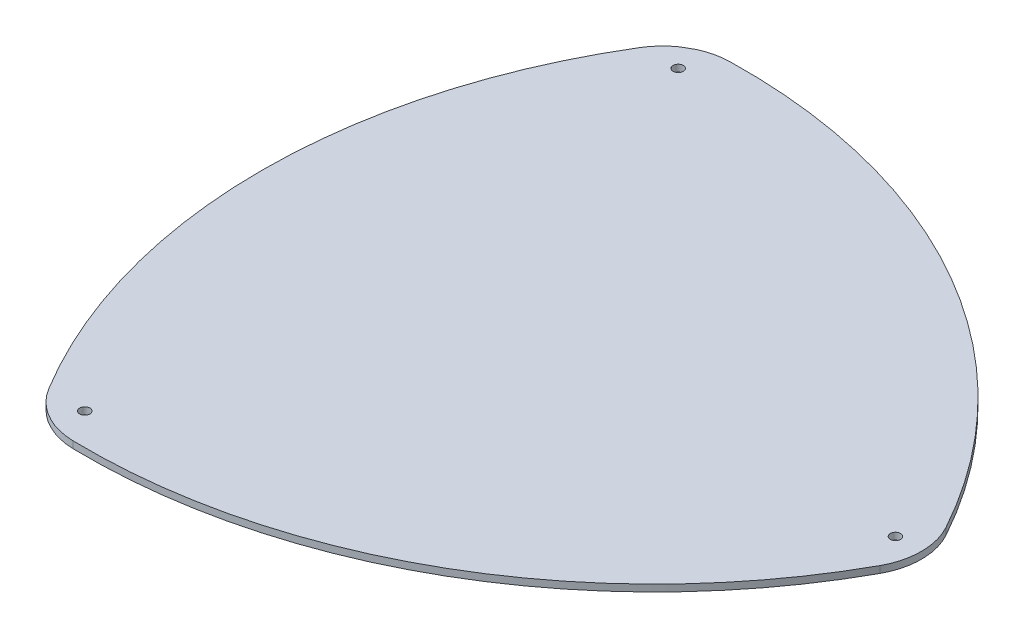
ISO-10303-21;
HEADER;
FILE_DESCRIPTION(('STEP AP214'),'2;1');
FILE_NAME('part.step','',(''),(''),'','','');
FILE_SCHEMA(('AUTOMOTIVE_DESIGN { 1 0 10303 214 1 1 1 1 }'));
ENDSEC;
DATA;
#1=APPLICATION_CONTEXT('core data for automotive mechanical design processes');
#2=APPLICATION_PROTOCOL_DEFINITION('international standard','automotive_design',2000,#1);
#3=PRODUCT_CONTEXT('',#1,'mechanical');
#4=PRODUCT('Part','Part','',(#3));
#5=PRODUCT_RELATED_PRODUCT_CATEGORY('part','',(#4));
#6=PRODUCT_DEFINITION_FORMATION('','',#4);
#7=PRODUCT_DEFINITION_CONTEXT('part definition',#1,'design');
#8=PRODUCT_DEFINITION('design','',#6,#7);
#9=PRODUCT_DEFINITION_SHAPE('','',#8);
#10=(LENGTH_UNIT() NAMED_UNIT(*) SI_UNIT(.MILLI.,.METRE.));
#11=(NAMED_UNIT(*) PLANE_ANGLE_UNIT() SI_UNIT($,.RADIAN.));
#12=(NAMED_UNIT(*) SI_UNIT($,.STERADIAN.) SOLID_ANGLE_UNIT());
#13=UNCERTAINTY_MEASURE_WITH_UNIT(LENGTH_MEASURE(1.E-05),#10,'distance_accuracy_value','');
#14=(GEOMETRIC_REPRESENTATION_CONTEXT(3) GLOBAL_UNCERTAINTY_ASSIGNED_CONTEXT((#13)) GLOBAL_UNIT_ASSIGNED_CONTEXT((#10,
#11,#12)) REPRESENTATION_CONTEXT('',''));
#15=CARTESIAN_POINT('',(0.,0.,0.));
#16=DIRECTION('',(0.,0.,1.));
#17=DIRECTION('',(1.,0.,0.));
#18=AXIS2_PLACEMENT_3D('',#15,#16,#17);
#19=CARTESIAN_POINT('',(81.249999999997,-3.,0.));
#20=DIRECTION('',(0.,-1.,0.));
#21=DIRECTION('',(0.,0.,-1.));
#22=AXIS2_PLACEMENT_3D('',#19,#20,#21);
#23=CYLINDRICAL_SURFACE('',#22,166.249999999998);
#24=CARTESIAN_POINT('',(81.249999999997,-5.,0.));
#25=DIRECTION('',(0.,1.,0.));
#26=DIRECTION('',(0.,0.,1.));
#27=AXIS2_PLACEMENT_3D('',#24,#25,#26);
#28=CIRCLE('',#27,166.249999999998);
#29=CARTESIAN_POINT('',(-60.8925208493732,-5.,-86.2239309390714));
#30=VERTEX_POINT('',#29);
#31=CARTESIAN_POINT('',(-60.8925208493732,-5.,86.2239309390713));
#32=VERTEX_POINT('',#31);
#33=EDGE_CURVE('E142',#30,#32,#28,.T.);
#34=ORIENTED_EDGE('',*,*,#33,.T.);
#35=DIRECTION('',(0.,-1.,0.));
#36=VECTOR('',#35,1.);
#37=CARTESIAN_POINT('',(-60.8925208493732,-3.,86.2239309390713));
#38=LINE('',#37,#36);
#39=CARTESIAN_POINT('',(-60.8925208493732,-3.,86.2239309390713));
#40=VERTEX_POINT('',#39);
#41=EDGE_CURVE('E11',#40,#32,#38,.T.);
#42=ORIENTED_EDGE('',*,*,#41,.F.);
#43=CARTESIAN_POINT('',(81.249999999997,-3.,0.));
#44=DIRECTION('',(0.,1.,0.));
#45=DIRECTION('',(0.,0.,1.));
#46=AXIS2_PLACEMENT_3D('',#43,#44,#45);
#47=CIRCLE('',#46,166.249999999998);
#48=CARTESIAN_POINT('',(-60.8925208493732,-3.,-86.2239309390714));
#49=VERTEX_POINT('',#48);
#50=EDGE_CURVE('E167',#49,#40,#47,.T.);
#51=ORIENTED_EDGE('',*,*,#50,.F.);
#52=DIRECTION('',(0.,-1.,0.));
#53=VECTOR('',#52,1.);
#54=CARTESIAN_POINT('',(-60.8925208493732,-3.,-86.2239309390714));
#55=LINE('',#54,#53);
#56=EDGE_CURVE('E53',#49,#30,#55,.T.);
#57=ORIENTED_EDGE('',*,*,#56,.T.);
#58=EDGE_LOOP('',(#34,#42,#51,#57));
#59=FACE_BOUND('',#58,.T.);
#60=ADVANCED_FACE('F37',(#59),#23,.T.);
#61=CARTESIAN_POINT('',(-43.792668717118,-3.,75.8511272170777));
#62=DIRECTION('',(0.,-1.,0.));
#63=DIRECTION('',(0.,0.,-1.));
#64=AXIS2_PLACEMENT_3D('',#61,#62,#63);
#65=CYLINDRICAL_SURFACE('',#64,19.9999999999999);
#66=CARTESIAN_POINT('',(-43.792668717118,-5.,75.8511272170777));
#67=DIRECTION('',(0.,1.,0.));
#68=DIRECTION('',(0.,0.,1.));
#69=AXIS2_PLACEMENT_3D('',#66,#67,#68);
#70=CIRCLE('',#69,19.9999999999999);
#71=CARTESIAN_POINT('',(-44.225854182707,-5.,95.8464354255651));
#72=VERTEX_POINT('',#71);
#73=EDGE_CURVE('E144',#32,#72,#70,.T.);
#74=ORIENTED_EDGE('',*,*,#73,.T.);
#75=DIRECTION('',(0.,-1.,0.));
#76=VECTOR('',#75,1.);
#77=CARTESIAN_POINT('',(-44.225854182707,-3.,95.8464354255651));
#78=LINE('',#77,#76);
#79=CARTESIAN_POINT('',(-44.225854182707,-3.,95.8464354255651));
#80=VERTEX_POINT('',#79);
#81=EDGE_CURVE('E45',#80,#72,#78,.T.);
#82=ORIENTED_EDGE('',*,*,#81,.F.);
#83=CARTESIAN_POINT('',(-43.792668717118,-3.,75.8511272170777));
#84=DIRECTION('',(0.,1.,0.));
#85=DIRECTION('',(0.,0.,1.));
#86=AXIS2_PLACEMENT_3D('',#83,#84,#85);
#87=CIRCLE('',#86,19.9999999999999);
#88=EDGE_CURVE('E91',#40,#80,#87,.T.);
#89=ORIENTED_EDGE('',*,*,#88,.F.);
#90=ORIENTED_EDGE('',*,*,#41,.T.);
#91=EDGE_LOOP('',(#74,#82,#89,#90));
#92=FACE_BOUND('',#91,.T.);
#93=ADVANCED_FACE('F197',(#92),#65,.T.);
#94=CARTESIAN_POINT('',(-40.6249999999987,-3.,-70.3645640574845));
#95=DIRECTION('',(0.,-1.,0.));
#96=DIRECTION('',(0.,0.,-1.));
#97=AXIS2_PLACEMENT_3D('',#94,#95,#96);
#98=CYLINDRICAL_SURFACE('',#97,166.249999999998);
#99=CARTESIAN_POINT('',(-40.6249999999987,-5.,-70.3645640574845));
#100=DIRECTION('',(0.,1.,0.));
#101=DIRECTION('',(0.,0.,1.));
#102=AXIS2_PLACEMENT_3D('',#99,#100,#101);
#103=CIRCLE('',#102,166.249999999998);
#104=CARTESIAN_POINT('',(105.118375032077,-5.,9.6225044864937));
#105=VERTEX_POINT('',#104);
#106=EDGE_CURVE('E146',#72,#105,#103,.T.);
#107=ORIENTED_EDGE('',*,*,#106,.T.);
#108=DIRECTION('',(0.,-1.,0.));
#109=VECTOR('',#108,1.);
#110=CARTESIAN_POINT('',(105.118375032077,-3.,9.6225044864937));
#111=LINE('',#110,#109);
#112=CARTESIAN_POINT('',(105.118375032077,-3.,9.6225044864937));
#113=VERTEX_POINT('',#112);
#114=EDGE_CURVE('E173',#113,#105,#111,.T.);
#115=ORIENTED_EDGE('',*,*,#114,.F.);
#116=CARTESIAN_POINT('',(-40.6249999999987,-3.,-70.3645640574845));
#117=DIRECTION('',(0.,1.,0.));
#118=DIRECTION('',(0.,0.,1.));
#119=AXIS2_PLACEMENT_3D('',#116,#117,#118);
#120=CIRCLE('',#119,166.249999999998);
#121=EDGE_CURVE('E181',#80,#113,#120,.T.);
#122=ORIENTED_EDGE('',*,*,#121,.F.);
#123=ORIENTED_EDGE('',*,*,#81,.T.);
#124=EDGE_LOOP('',(#107,#115,#122,#123));
#125=FACE_BOUND('',#124,.T.);
#126=ADVANCED_FACE('F179',(#125),#98,.T.);
#127=CARTESIAN_POINT('',(87.5853374342335,-3.,0.));
#128=DIRECTION('',(0.,-1.,0.));
#129=DIRECTION('',(0.,0.,-1.));
#130=AXIS2_PLACEMENT_3D('',#127,#128,#129);
#131=CYLINDRICAL_SURFACE('',#130,20.);
#132=CARTESIAN_POINT('',(87.5853374342335,-5.,0.));
#133=DIRECTION('',(0.,1.,0.));
#134=DIRECTION('',(0.,0.,1.));
#135=AXIS2_PLACEMENT_3D('',#132,#133,#134);
#136=CIRCLE('',#135,20.);
#137=CARTESIAN_POINT('',(105.118375032077,-5.,-9.62250448649367));
#138=VERTEX_POINT('',#137);
#139=EDGE_CURVE('E148',#105,#138,#136,.T.);
#140=ORIENTED_EDGE('',*,*,#139,.T.);
#141=DIRECTION('',(0.,-1.,0.));
#142=VECTOR('',#141,1.);
#143=CARTESIAN_POINT('',(105.118375032077,-3.,-9.62250448649367));
#144=LINE('',#143,#142);
#145=CARTESIAN_POINT('',(105.118375032077,-3.,-9.62250448649367));
#146=VERTEX_POINT('',#145);
#147=EDGE_CURVE('E171',#146,#138,#144,.T.);
#148=ORIENTED_EDGE('',*,*,#147,.F.);
#149=CARTESIAN_POINT('',(87.5853374342335,-3.,0.));
#150=DIRECTION('',(0.,1.,0.));
#151=DIRECTION('',(0.,0.,1.));
#152=AXIS2_PLACEMENT_3D('',#149,#150,#151);
#153=CIRCLE('',#152,20.);
#154=EDGE_CURVE('E191',#113,#146,#153,.T.);
#155=ORIENTED_EDGE('',*,*,#154,.F.);
#156=ORIENTED_EDGE('',*,*,#114,.T.);
#157=EDGE_LOOP('',(#140,#148,#155,#156));
#158=FACE_BOUND('',#157,.T.);
#159=ADVANCED_FACE('F189',(#158),#131,.T.);
#160=CARTESIAN_POINT('',(-40.6249999999986,-3.,70.3645640574845));
#161=DIRECTION('',(0.,-1.,0.));
#162=DIRECTION('',(0.,0.,-1.));
#163=AXIS2_PLACEMENT_3D('',#160,#161,#162);
#164=CYLINDRICAL_SURFACE('',#163,166.249999999998);
#165=CARTESIAN_POINT('',(-40.6249999999986,-5.,70.3645640574845));
#166=DIRECTION('',(0.,1.,0.));
#167=DIRECTION('',(0.,0.,1.));
#168=AXIS2_PLACEMENT_3D('',#165,#166,#167);
#169=CIRCLE('',#168,166.249999999998);
#170=CARTESIAN_POINT('',(-44.225854182707,-5.,-95.846435425565));
#171=VERTEX_POINT('',#170);
#172=EDGE_CURVE('E151',#171,#138,#169,.F.);
#173=ORIENTED_EDGE('',*,*,#172,.F.);
#174=DIRECTION('',(0.,-1.,0.));
#175=VECTOR('',#174,1.);
#176=CARTESIAN_POINT('',(-44.225854182707,-3.,-95.846435425565));
#177=LINE('',#176,#175);
#178=CARTESIAN_POINT('',(-44.225854182707,-3.,-95.846435425565));
#179=VERTEX_POINT('',#178);
#180=EDGE_CURVE('E116',#179,#171,#177,.T.);
#181=ORIENTED_EDGE('',*,*,#180,.F.);
#182=CARTESIAN_POINT('',(-40.6249999999986,-3.,70.3645640574845));
#183=DIRECTION('',(0.,1.,0.));
#184=DIRECTION('',(0.,0.,1.));
#185=AXIS2_PLACEMENT_3D('',#182,#183,#184);
#186=CIRCLE('',#185,166.249999999998);
#187=EDGE_CURVE('E126',#179,#146,#186,.F.);
#188=ORIENTED_EDGE('',*,*,#187,.T.);
#189=ORIENTED_EDGE('',*,*,#147,.T.);
#190=EDGE_LOOP('',(#173,#181,#188,#189));
#191=FACE_BOUND('',#190,.T.);
#192=ADVANCED_FACE('F207',(#191),#164,.T.);
#193=CARTESIAN_POINT('',(-43.792668717118,-3.,-75.8511272170777));
#194=DIRECTION('',(0.,-1.,0.));
#195=DIRECTION('',(0.,0.,-1.));
#196=AXIS2_PLACEMENT_3D('',#193,#194,#195);
#197=CYLINDRICAL_SURFACE('',#196,20.);
#198=CARTESIAN_POINT('',(-43.792668717118,-5.,-75.8511272170777));
#199=DIRECTION('',(0.,1.,0.));
#200=DIRECTION('',(0.,0.,1.));
#201=AXIS2_PLACEMENT_3D('',#198,#199,#200);
#202=CIRCLE('',#201,20.);
#203=CARTESIAN_POINT('',(-52.1516692555236,-5.,-94.0205275924047));
#204=VERTEX_POINT('',#203);
#205=EDGE_CURVE('E112',#204,#171,#202,.F.);
#206=ORIENTED_EDGE('',*,*,#205,.F.);
#207=DIRECTION('',(0.,-1.,0.));
#208=VECTOR('',#207,1.);
#209=CARTESIAN_POINT('',(-52.1516692555236,-3.,-94.0205275924047));
#210=LINE('',#209,#208);
#211=CARTESIAN_POINT('',(-52.1516692555236,-3.,-94.0205275924047));
#212=VERTEX_POINT('',#211);
#213=EDGE_CURVE('E107',#212,#204,#210,.T.);
#214=ORIENTED_EDGE('',*,*,#213,.F.);
#215=CARTESIAN_POINT('',(-43.792668717118,-3.,-75.8511272170777));
#216=DIRECTION('',(0.,1.,0.));
#217=DIRECTION('',(0.,0.,1.));
#218=AXIS2_PLACEMENT_3D('',#215,#216,#217);
#219=CIRCLE('',#218,20.);
#220=EDGE_CURVE('E110',#212,#179,#219,.F.);
#221=ORIENTED_EDGE('',*,*,#220,.T.);
#222=ORIENTED_EDGE('',*,*,#180,.T.);
#223=EDGE_LOOP('',(#206,#214,#221,#222));
#224=FACE_BOUND('',#223,.T.);
#225=ADVANCED_FACE('F109',(#224),#197,.T.);
#226=CARTESIAN_POINT('',(-53.7500000000014,-3.,-93.0977309068264));
#227=DIRECTION('',(-0.500000000000013,0.,-0.866025403784431));
#228=DIRECTION('',(-0.866025403784431,0.,0.500000000000013));
#229=AXIS2_PLACEMENT_3D('',#226,#227,#228);
#230=PLANE('',#229);
#231=DIRECTION('',(0.866025403784431,0.,-0.500000000000013));
#232=VECTOR('',#231,1.);
#233=CARTESIAN_POINT('',(-53.7500000000014,-5.,-93.0977309068264));
#234=LINE('',#233,#232);
#235=CARTESIAN_POINT('',(-55.3483307444794,-5.,-92.1749342212479));
#236=VERTEX_POINT('',#235);
#237=EDGE_CURVE('E155',#236,#204,#234,.T.);
#238=ORIENTED_EDGE('',*,*,#237,.F.);
#239=DIRECTION('',(0.,-1.,0.));
#240=VECTOR('',#239,1.);
#241=CARTESIAN_POINT('',(-55.3483307444794,-3.,-92.1749342212479));
#242=LINE('',#241,#240);
#243=CARTESIAN_POINT('',(-55.3483307444794,-3.,-92.1749342212479));
#244=VERTEX_POINT('',#243);
#245=EDGE_CURVE('E79',#244,#236,#242,.T.);
#246=ORIENTED_EDGE('',*,*,#245,.F.);
#247=DIRECTION('',(0.866025403784431,0.,-0.500000000000013));
#248=VECTOR('',#247,1.);
#249=CARTESIAN_POINT('',(-53.7500000000014,-3.,-93.0977309068264));
#250=LINE('',#249,#248);
#251=EDGE_CURVE('E124',#244,#212,#250,.T.);
#252=ORIENTED_EDGE('',*,*,#251,.T.);
#253=ORIENTED_EDGE('',*,*,#213,.T.);
#254=EDGE_LOOP('',(#238,#246,#252,#253));
#255=FACE_BOUND('',#254,.T.);
#256=ADVANCED_FACE('F129',(#255),#230,.T.);
#257=CARTESIAN_POINT('',(100.,-3.,0.));
#258=DIRECTION('',(0.,-1.,0.));
#259=DIRECTION('',(0.,0.,-1.));
#260=AXIS2_PLACEMENT_3D('',#257,#258,#259);
#261=CYLINDRICAL_SURFACE('',#260,1.5);
#262=CARTESIAN_POINT('',(100.,-3.,0.));
#263=DIRECTION('',(0.,1.,0.));
#264=DIRECTION('',(0.,0.,1.));
#265=AXIS2_PLACEMENT_3D('',#262,#263,#264);
#266=CIRCLE('',#265,1.5);
#267=CARTESIAN_POINT('',(100.,-3.,1.5));
#268=VERTEX_POINT('',#267);
#269=EDGE_CURVE('E136',#268,#268,#266,.T.);
#270=ORIENTED_EDGE('',*,*,#269,.T.);
#271=EDGE_LOOP('',(#270));
#272=FACE_BOUND('',#271,.T.);
#273=CARTESIAN_POINT('',(100.,-5.,0.));
#274=DIRECTION('',(0.,1.,0.));
#275=DIRECTION('',(0.,0.,1.));
#276=AXIS2_PLACEMENT_3D('',#273,#274,#275);
#277=CIRCLE('',#276,1.5);
#278=CARTESIAN_POINT('',(100.,-5.,1.5));
#279=VERTEX_POINT('',#278);
#280=EDGE_CURVE('E161',#279,#279,#277,.T.);
#281=ORIENTED_EDGE('',*,*,#280,.F.);
#282=EDGE_LOOP('',(#281));
#283=FACE_BOUND('',#282,.T.);
#284=ADVANCED_FACE('F213',(#272,#283),#261,.F.);
#285=CARTESIAN_POINT('',(-50.0000000000012,-3.,-86.6025403784432));
#286=DIRECTION('',(0.,-1.,0.));
#287=DIRECTION('',(0.,0.,-1.));
#288=AXIS2_PLACEMENT_3D('',#285,#286,#287);
#289=CYLINDRICAL_SURFACE('',#288,1.5);
#290=CARTESIAN_POINT('',(-50.0000000000012,-3.,-86.6025403784432));
#291=DIRECTION('',(0.,1.,0.));
#292=DIRECTION('',(0.,0.,1.));
#293=AXIS2_PLACEMENT_3D('',#290,#291,#292);
#294=CIRCLE('',#293,1.5);
#295=CARTESIAN_POINT('',(-50.0000000000012,-3.,-85.1025403784432));
#296=VERTEX_POINT('',#295);
#297=EDGE_CURVE('E131',#296,#296,#294,.T.);
#298=ORIENTED_EDGE('',*,*,#297,.T.);
#299=EDGE_LOOP('',(#298));
#300=FACE_BOUND('',#299,.T.);
#301=CARTESIAN_POINT('',(-50.0000000000012,-5.,-86.6025403784432));
#302=DIRECTION('',(0.,1.,0.));
#303=DIRECTION('',(0.,0.,1.));
#304=AXIS2_PLACEMENT_3D('',#301,#302,#303);
#305=CIRCLE('',#304,1.5);
#306=CARTESIAN_POINT('',(-50.0000000000012,-5.,-85.1025403784432));
#307=VERTEX_POINT('',#306);
#308=EDGE_CURVE('E158',#307,#307,#305,.T.);
#309=ORIENTED_EDGE('',*,*,#308,.F.);
#310=EDGE_LOOP('',(#309));
#311=FACE_BOUND('',#310,.T.);
#312=ADVANCED_FACE('F218',(#300,#311),#289,.F.);
#313=EDGE_CURVE('E156',#30,#236,#202,.F.);
#314=ORIENTED_EDGE('',*,*,#313,.F.);
#315=ORIENTED_EDGE('',*,*,#56,.F.);
#316=EDGE_CURVE('E128',#49,#244,#219,.F.);
#317=ORIENTED_EDGE('',*,*,#316,.T.);
#318=ORIENTED_EDGE('',*,*,#245,.T.);
#319=EDGE_LOOP('',(#314,#315,#317,#318));
#320=FACE_BOUND('',#319,.T.);
#321=ADVANCED_FACE('F214',(#320),#197,.T.);
#322=CARTESIAN_POINT('',(-50.0000000000012,-3.,86.6025403784432));
#323=DIRECTION('',(0.,-1.,0.));
#324=DIRECTION('',(0.,0.,-1.));
#325=AXIS2_PLACEMENT_3D('',#322,#323,#324);
#326=CYLINDRICAL_SURFACE('',#325,1.5);
#327=CARTESIAN_POINT('',(-50.0000000000012,-3.,86.6025403784432));
#328=DIRECTION('',(0.,1.,0.));
#329=DIRECTION('',(0.,0.,1.));
#330=AXIS2_PLACEMENT_3D('',#327,#328,#329);
#331=CIRCLE('',#330,1.5);
#332=CARTESIAN_POINT('',(-50.0000000000012,-3.,88.1025403784432));
#333=VERTEX_POINT('',#332);
#334=EDGE_CURVE('E139',#333,#333,#331,.T.);
#335=ORIENTED_EDGE('',*,*,#334,.T.);
#336=EDGE_LOOP('',(#335));
#337=FACE_BOUND('',#336,.T.);
#338=CARTESIAN_POINT('',(-50.0000000000012,-5.,86.6025403784432));
#339=DIRECTION('',(0.,1.,0.));
#340=DIRECTION('',(0.,0.,1.));
#341=AXIS2_PLACEMENT_3D('',#338,#339,#340);
#342=CIRCLE('',#341,1.5);
#343=CARTESIAN_POINT('',(-50.0000000000012,-5.,88.1025403784432));
#344=VERTEX_POINT('',#343);
#345=EDGE_CURVE('E164',#344,#344,#342,.T.);
#346=ORIENTED_EDGE('',*,*,#345,.F.);
#347=EDGE_LOOP('',(#346));
#348=FACE_BOUND('',#347,.T.);
#349=ADVANCED_FACE('F217',(#337,#348),#326,.F.);
#350=CARTESIAN_POINT('',(0.,-3.,0.));
#351=DIRECTION('',(0.,1.,0.));
#352=DIRECTION('',(0.,0.,1.));
#353=AXIS2_PLACEMENT_3D('',#350,#351,#352);
#354=PLANE('',#353);
#355=ORIENTED_EDGE('',*,*,#50,.T.);
#356=ORIENTED_EDGE('',*,*,#88,.T.);
#357=ORIENTED_EDGE('',*,*,#121,.T.);
#358=ORIENTED_EDGE('',*,*,#154,.T.);
#359=ORIENTED_EDGE('',*,*,#187,.F.);
#360=ORIENTED_EDGE('',*,*,#220,.F.);
#361=ORIENTED_EDGE('',*,*,#251,.F.);
#362=ORIENTED_EDGE('',*,*,#316,.F.);
#363=EDGE_LOOP('',(#355,#356,#357,#358,#359,#360,#361,#362));
#364=FACE_BOUND('',#363,.T.);
#365=ORIENTED_EDGE('',*,*,#297,.F.);
#366=EDGE_LOOP('',(#365));
#367=FACE_BOUND('',#366,.T.);
#368=ORIENTED_EDGE('',*,*,#269,.F.);
#369=EDGE_LOOP('',(#368));
#370=FACE_BOUND('',#369,.T.);
#371=ORIENTED_EDGE('',*,*,#334,.F.);
#372=EDGE_LOOP('',(#371));
#373=FACE_BOUND('',#372,.T.);
#374=ADVANCED_FACE('F121',(#364,#367,#370,#373),#354,.T.);
#375=CARTESIAN_POINT('',(0.,-5.,0.));
#376=DIRECTION('',(0.,1.,0.));
#377=DIRECTION('',(0.,0.,1.));
#378=AXIS2_PLACEMENT_3D('',#375,#376,#377);
#379=PLANE('',#378);
#380=ORIENTED_EDGE('',*,*,#33,.F.);
#381=ORIENTED_EDGE('',*,*,#313,.T.);
#382=ORIENTED_EDGE('',*,*,#237,.T.);
#383=ORIENTED_EDGE('',*,*,#205,.T.);
#384=ORIENTED_EDGE('',*,*,#172,.T.);
#385=ORIENTED_EDGE('',*,*,#139,.F.);
#386=ORIENTED_EDGE('',*,*,#106,.F.);
#387=ORIENTED_EDGE('',*,*,#73,.F.);
#388=EDGE_LOOP('',(#380,#381,#382,#383,#384,#385,#386,#387));
#389=FACE_BOUND('',#388,.T.);
#390=ORIENTED_EDGE('',*,*,#308,.T.);
#391=EDGE_LOOP('',(#390));
#392=FACE_BOUND('',#391,.T.);
#393=ORIENTED_EDGE('',*,*,#280,.T.);
#394=EDGE_LOOP('',(#393));
#395=FACE_BOUND('',#394,.T.);
#396=ORIENTED_EDGE('',*,*,#345,.T.);
#397=EDGE_LOOP('',(#396));
#398=FACE_BOUND('',#397,.T.);
#399=ADVANCED_FACE('F184',(#389,#392,#395,#398),#379,.F.);
#400=CLOSED_SHELL('',(#60,#93,#126,#159,#192,#225,#256,#284,#312,#321,#349,#374,#399));
#401=MANIFOLD_SOLID_BREP('B2',#400);
#402=ADVANCED_BREP_SHAPE_REPRESENTATION('',(#18,#401),#14);
#403=SHAPE_DEFINITION_REPRESENTATION(#9,#402);
ENDSEC;
END-ISO-10303-21;
